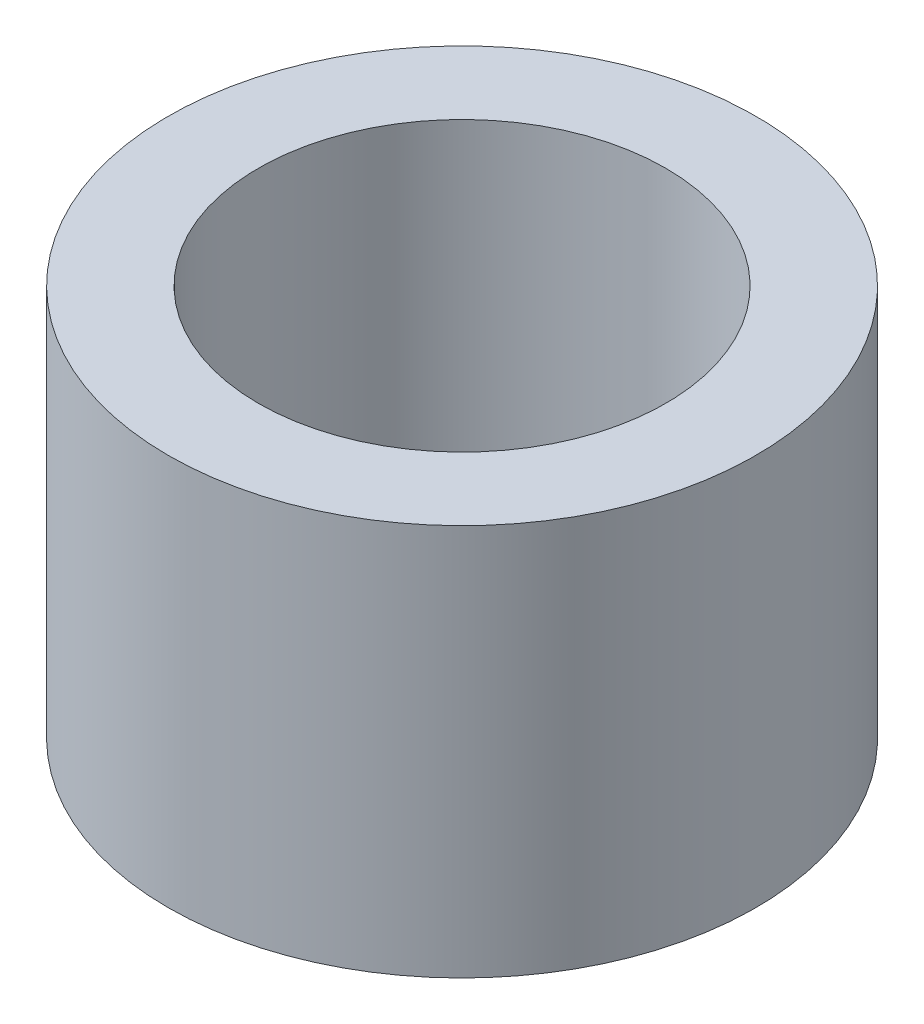
ISO-10303-21;
HEADER;
FILE_DESCRIPTION(('STEP AP214'),'2;1');
FILE_NAME('part.step','',(''),(''),'','','');
FILE_SCHEMA(('AUTOMOTIVE_DESIGN { 1 0 10303 214 1 1 1 1 }'));
ENDSEC;
DATA;
#1=APPLICATION_CONTEXT('core data for automotive mechanical design processes');
#2=APPLICATION_PROTOCOL_DEFINITION('international standard','automotive_design',2000,#1);
#3=PRODUCT_CONTEXT('',#1,'mechanical');
#4=PRODUCT('Part','Part','',(#3));
#5=PRODUCT_RELATED_PRODUCT_CATEGORY('part','',(#4));
#6=PRODUCT_DEFINITION_FORMATION('','',#4);
#7=PRODUCT_DEFINITION_CONTEXT('part definition',#1,'design');
#8=PRODUCT_DEFINITION('design','',#6,#7);
#9=PRODUCT_DEFINITION_SHAPE('','',#8);
#10=(LENGTH_UNIT() NAMED_UNIT(*) SI_UNIT(.MILLI.,.METRE.));
#11=(NAMED_UNIT(*) PLANE_ANGLE_UNIT() SI_UNIT($,.RADIAN.));
#12=(NAMED_UNIT(*) SI_UNIT($,.STERADIAN.) SOLID_ANGLE_UNIT());
#13=UNCERTAINTY_MEASURE_WITH_UNIT(LENGTH_MEASURE(1.E-05),#10,'distance_accuracy_value','');
#14=(GEOMETRIC_REPRESENTATION_CONTEXT(3) GLOBAL_UNCERTAINTY_ASSIGNED_CONTEXT((#13)) GLOBAL_UNIT_ASSIGNED_CONTEXT((#10,
#11,#12)) REPRESENTATION_CONTEXT('',''));
#15=CARTESIAN_POINT('',(0.,0.,0.));
#16=DIRECTION('',(0.,0.,1.));
#17=DIRECTION('',(1.,0.,0.));
#18=AXIS2_PLACEMENT_3D('',#15,#16,#17);
#19=CARTESIAN_POINT('',(0.,6.35,0.));
#20=DIRECTION('',(0.,1.,0.));
#21=DIRECTION('',(0.,0.,1.));
#22=AXIS2_PLACEMENT_3D('',#19,#20,#21);
#23=PLANE('',#22);
#24=CARTESIAN_POINT('',(0.,6.35,0.));
#25=DIRECTION('',(0.,1.,0.));
#26=DIRECTION('',(0.,0.,1.));
#27=AXIS2_PLACEMENT_3D('',#24,#25,#26);
#28=CIRCLE('',#27,4.7625);
#29=CARTESIAN_POINT('',(0.,6.35,4.7625));
#30=VERTEX_POINT('',#29);
#31=EDGE_CURVE('E10',#30,#30,#28,.T.);
#32=ORIENTED_EDGE('',*,*,#31,.T.);
#33=EDGE_LOOP('',(#32));
#34=FACE_BOUND('',#33,.T.);
#35=CARTESIAN_POINT('',(0.,6.35,0.));
#36=DIRECTION('',(0.,1.,0.));
#37=DIRECTION('',(0.,0.,1.));
#38=AXIS2_PLACEMENT_3D('',#35,#36,#37);
#39=CIRCLE('',#38,3.302);
#40=CARTESIAN_POINT('',(0.,6.35,3.302));
#41=VERTEX_POINT('',#40);
#42=EDGE_CURVE('E42',#41,#41,#39,.T.);
#43=ORIENTED_EDGE('',*,*,#42,.F.);
#44=EDGE_LOOP('',(#43));
#45=FACE_BOUND('',#44,.T.);
#46=ADVANCED_FACE('F31',(#34,#45),#23,.T.);
#47=CARTESIAN_POINT('',(0.,0.,0.));
#48=DIRECTION('',(0.,1.,0.));
#49=DIRECTION('',(0.,0.,1.));
#50=AXIS2_PLACEMENT_3D('',#47,#48,#49);
#51=PLANE('',#50);
#52=CARTESIAN_POINT('',(0.,0.,0.));
#53=DIRECTION('',(0.,1.,0.));
#54=DIRECTION('',(0.,0.,1.));
#55=AXIS2_PLACEMENT_3D('',#52,#53,#54);
#56=CIRCLE('',#55,4.7625);
#57=CARTESIAN_POINT('',(0.,0.,4.7625));
#58=VERTEX_POINT('',#57);
#59=EDGE_CURVE('E35',#58,#58,#56,.T.);
#60=ORIENTED_EDGE('',*,*,#59,.F.);
#61=EDGE_LOOP('',(#60));
#62=FACE_BOUND('',#61,.T.);
#63=CARTESIAN_POINT('',(0.,0.,0.));
#64=DIRECTION('',(0.,1.,0.));
#65=DIRECTION('',(0.,0.,1.));
#66=AXIS2_PLACEMENT_3D('',#63,#64,#65);
#67=CIRCLE('',#66,3.302);
#68=CARTESIAN_POINT('',(0.,0.,3.302));
#69=VERTEX_POINT('',#68);
#70=EDGE_CURVE('E44',#69,#69,#67,.T.);
#71=ORIENTED_EDGE('',*,*,#70,.T.);
#72=EDGE_LOOP('',(#71));
#73=FACE_BOUND('',#72,.T.);
#74=ADVANCED_FACE('F54',(#62,#73),#51,.F.);
#75=CARTESIAN_POINT('',(0.,6.35,0.));
#76=DIRECTION('',(0.,-1.,0.));
#77=DIRECTION('',(0.,0.,-1.));
#78=AXIS2_PLACEMENT_3D('',#75,#76,#77);
#79=CYLINDRICAL_SURFACE('',#78,4.7625);
#80=ORIENTED_EDGE('',*,*,#31,.F.);
#81=EDGE_LOOP('',(#80));
#82=FACE_BOUND('',#81,.T.);
#83=ORIENTED_EDGE('',*,*,#59,.T.);
#84=EDGE_LOOP('',(#83));
#85=FACE_BOUND('',#84,.T.);
#86=ADVANCED_FACE('F33',(#82,#85),#79,.T.);
#87=CARTESIAN_POINT('',(0.,6.35,0.));
#88=DIRECTION('',(0.,-1.,0.));
#89=DIRECTION('',(0.,0.,-1.));
#90=AXIS2_PLACEMENT_3D('',#87,#88,#89);
#91=CYLINDRICAL_SURFACE('',#90,3.302);
#92=ORIENTED_EDGE('',*,*,#42,.T.);
#93=EDGE_LOOP('',(#92));
#94=FACE_BOUND('',#93,.T.);
#95=ORIENTED_EDGE('',*,*,#70,.F.);
#96=EDGE_LOOP('',(#95));
#97=FACE_BOUND('',#96,.T.);
#98=ADVANCED_FACE('F50',(#94,#97),#91,.F.);
#99=CLOSED_SHELL('',(#46,#74,#86,#98));
#100=MANIFOLD_SOLID_BREP('B2',#99);
#101=ADVANCED_BREP_SHAPE_REPRESENTATION('',(#18,#100),#14);
#102=SHAPE_DEFINITION_REPRESENTATION(#9,#101);
ENDSEC;
END-ISO-10303-21;
